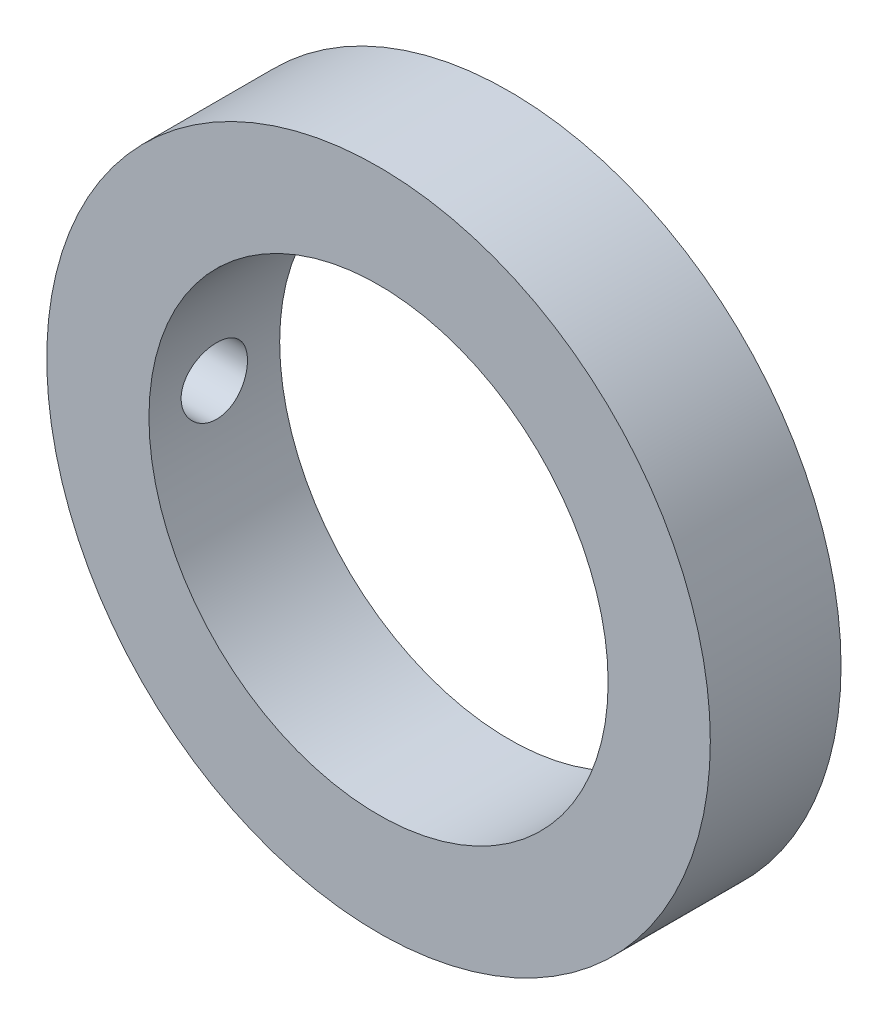
ISO-10303-21;
HEADER;
FILE_DESCRIPTION(('STEP AP214'),'2;1');
FILE_NAME('part.step','',(''),(''),'','','');
FILE_SCHEMA(('AUTOMOTIVE_DESIGN { 1 0 10303 214 1 1 1 1 }'));
ENDSEC;
DATA;
#1=APPLICATION_CONTEXT('core data for automotive mechanical design processes');
#2=APPLICATION_PROTOCOL_DEFINITION('international standard','automotive_design',2000,#1);
#3=PRODUCT_CONTEXT('',#1,'mechanical');
#4=PRODUCT('Part','Part','',(#3));
#5=PRODUCT_RELATED_PRODUCT_CATEGORY('part','',(#4));
#6=PRODUCT_DEFINITION_FORMATION('','',#4);
#7=PRODUCT_DEFINITION_CONTEXT('part definition',#1,'design');
#8=PRODUCT_DEFINITION('design','',#6,#7);
#9=PRODUCT_DEFINITION_SHAPE('','',#8);
#10=(LENGTH_UNIT() NAMED_UNIT(*) SI_UNIT(.MILLI.,.METRE.));
#11=(NAMED_UNIT(*) PLANE_ANGLE_UNIT() SI_UNIT($,.RADIAN.));
#12=(NAMED_UNIT(*) SI_UNIT($,.STERADIAN.) SOLID_ANGLE_UNIT());
#13=UNCERTAINTY_MEASURE_WITH_UNIT(LENGTH_MEASURE(1.E-05),#10,'distance_accuracy_value','');
#14=(GEOMETRIC_REPRESENTATION_CONTEXT(3) GLOBAL_UNCERTAINTY_ASSIGNED_CONTEXT((#13)) GLOBAL_UNIT_ASSIGNED_CONTEXT((#10,
#11,#12)) REPRESENTATION_CONTEXT('',''));
#15=CARTESIAN_POINT('',(0.,0.,0.));
#16=DIRECTION('',(0.,0.,1.));
#17=DIRECTION('',(1.,0.,0.));
#18=AXIS2_PLACEMENT_3D('',#15,#16,#17);
#19=CARTESIAN_POINT('',(0.,0.,9.85));
#20=DIRECTION('',(0.,0.,1.));
#21=DIRECTION('',(1.,0.,0.));
#22=AXIS2_PLACEMENT_3D('',#19,#20,#21);
#23=PLANE('',#22);
#24=CARTESIAN_POINT('',(0.,0.,9.85));
#25=DIRECTION('',(0.,0.,1.));
#26=DIRECTION('',(1.,0.,0.));
#27=AXIS2_PLACEMENT_3D('',#24,#25,#26);
#28=CIRCLE('',#27,25.);
#29=CARTESIAN_POINT('',(25.,0.,9.85));
#30=VERTEX_POINT('',#29);
#31=EDGE_CURVE('E10',#30,#30,#28,.T.);
#32=ORIENTED_EDGE('',*,*,#31,.T.);
#33=EDGE_LOOP('',(#32));
#34=FACE_BOUND('',#33,.T.);
#35=CARTESIAN_POINT('',(0.,0.,9.85));
#36=DIRECTION('',(0.,0.,1.));
#37=DIRECTION('',(1.,0.,0.));
#38=AXIS2_PLACEMENT_3D('',#35,#36,#37);
#39=CIRCLE('',#38,17.3);
#40=CARTESIAN_POINT('',(17.3,0.,9.85));
#41=VERTEX_POINT('',#40);
#42=EDGE_CURVE('E53',#41,#41,#39,.T.);
#43=ORIENTED_EDGE('',*,*,#42,.F.);
#44=EDGE_LOOP('',(#43));
#45=FACE_BOUND('',#44,.T.);
#46=ADVANCED_FACE('F35',(#34,#45),#23,.T.);
#47=CARTESIAN_POINT('',(0.,0.,0.));
#48=DIRECTION('',(0.,0.,1.));
#49=DIRECTION('',(1.,0.,0.));
#50=AXIS2_PLACEMENT_3D('',#47,#48,#49);
#51=PLANE('',#50);
#52=CARTESIAN_POINT('',(0.,0.,0.));
#53=DIRECTION('',(0.,0.,1.));
#54=DIRECTION('',(1.,0.,0.));
#55=AXIS2_PLACEMENT_3D('',#52,#53,#54);
#56=CIRCLE('',#55,25.);
#57=CARTESIAN_POINT('',(25.,0.,0.));
#58=VERTEX_POINT('',#57);
#59=EDGE_CURVE('E48',#58,#58,#56,.T.);
#60=ORIENTED_EDGE('',*,*,#59,.F.);
#61=EDGE_LOOP('',(#60));
#62=FACE_BOUND('',#61,.T.);
#63=CARTESIAN_POINT('',(0.,0.,0.));
#64=DIRECTION('',(0.,0.,1.));
#65=DIRECTION('',(1.,0.,0.));
#66=AXIS2_PLACEMENT_3D('',#63,#64,#65);
#67=CIRCLE('',#66,17.3);
#68=CARTESIAN_POINT('',(17.3,0.,0.));
#69=VERTEX_POINT('',#68);
#70=EDGE_CURVE('E55',#69,#69,#67,.T.);
#71=ORIENTED_EDGE('',*,*,#70,.T.);
#72=EDGE_LOOP('',(#71));
#73=FACE_BOUND('',#72,.T.);
#74=ADVANCED_FACE('F75',(#62,#73),#51,.F.);
#75=CARTESIAN_POINT('',(0.,0.,9.85));
#76=DIRECTION('',(0.,0.,-1.));
#77=DIRECTION('',(-1.,0.,0.));
#78=AXIS2_PLACEMENT_3D('',#75,#76,#77);
#79=CYLINDRICAL_SURFACE('',#78,25.);
#80=CARTESIAN_POINT('',(-25.,0.,2.425));
#81=CARTESIAN_POINT('',(-24.9999983880192,0.140050884478893,2.42500606475095));
#82=CARTESIAN_POINT('',(-24.9988106399051,0.280194362919433,2.43680817224111));
#83=CARTESIAN_POINT('',(-24.9941866898684,0.556595996242092,2.48371092572607));
#84=CARTESIAN_POINT('',(-24.9907480108506,0.69284969792207,2.51883724006147));
#85=CARTESIAN_POINT('',(-24.9820103640768,0.957429188633536,2.61135560149458));
#86=CARTESIAN_POINT('',(-24.9767125200177,1.08575971153727,2.66873420129619));
#87=CARTESIAN_POINT('',(-24.9648489348577,1.33094040240102,2.80410226982911));
#88=CARTESIAN_POINT('',(-24.9582834459533,1.44779284694769,2.88208764000035));
#89=CARTESIAN_POINT('',(-24.9445936085331,1.6671488766852,3.05675674415569));
#90=CARTESIAN_POINT('',(-24.9374675393466,1.76960536208723,3.15349949850508));
#91=CARTESIAN_POINT('',(-24.9234739226566,1.95685630357746,3.36281133565757));
#92=CARTESIAN_POINT('',(-24.9166063871229,2.04164994270663,3.47538115010597));
#93=CARTESIAN_POINT('',(-24.9038897888196,2.19133492610904,3.71344632920905));
#94=CARTESIAN_POINT('',(-24.8980429177726,2.2561836636372,3.83896861023715));
#95=CARTESIAN_POINT('',(-24.8880509386631,2.3638659618569,4.09918896476245));
#96=CARTESIAN_POINT('',(-24.8839057885556,2.40670006647823,4.23388681145987));
#97=CARTESIAN_POINT('',(-24.8778021018244,2.46899760400473,4.50815450216502));
#98=CARTESIAN_POINT('',(-24.8758362599524,2.48853913250949,4.64770644213052));
#99=CARTESIAN_POINT('',(-24.8742910765131,2.5039382128384,4.92812215848945));
#100=CARTESIAN_POINT('',(-24.8747116722186,2.499796387177,5.06898590030515));
#101=CARTESIAN_POINT('',(-24.8778851724734,2.4680107006317,5.3474882742333));
#102=CARTESIAN_POINT('',(-24.8806296147663,2.44045211031138,5.48513674832174));
#103=CARTESIAN_POINT('',(-24.8881283571855,2.36274786037647,5.75384490800274));
#104=CARTESIAN_POINT('',(-24.8928826844623,2.31260189563937,5.88490450456258));
#105=CARTESIAN_POINT('',(-24.9038752363018,2.19105223470377,6.13698396824722));
#106=CARTESIAN_POINT('',(-24.9101160977039,2.11961070679995,6.25798547372329));
#107=CARTESIAN_POINT('',(-24.923376293322,1.95752506838307,6.48631303727971));
#108=CARTESIAN_POINT('',(-24.9303956503196,1.86688039584126,6.59363869495441));
#109=CARTESIAN_POINT('',(-24.9444596328247,1.66848528103017,6.79206348497257));
#110=CARTESIAN_POINT('',(-24.9515042333249,1.56066119712841,6.88308900470201));
#111=CARTESIAN_POINT('',(-24.964795726963,1.33122370434278,7.04575908227597));
#112=CARTESIAN_POINT('',(-24.9710426192064,1.209610279999,7.11740361839119));
#113=CARTESIAN_POINT('',(-24.9820368916774,0.955995264230911,7.23927505077563));
#114=CARTESIAN_POINT('',(-24.9867840103692,0.823991865974758,7.28949821204515));
#115=CARTESIAN_POINT('',(-24.9942411860352,0.55336804332483,7.36704729177938));
#116=CARTESIAN_POINT('',(-24.9969513039266,0.4147478169415,7.39437389497656));
#117=CARTESIAN_POINT('',(-25.0000212917078,0.135462747729759,7.42526076933691));
#118=CARTESIAN_POINT('',(-25.0003912066934,-0.00519075526373019,7.42892262063125));
#119=CARTESIAN_POINT('',(-24.9987660439199,-0.28510948328925,7.41264284237809));
#120=CARTESIAN_POINT('',(-24.9967709981117,-0.424374727051175,7.3927015317118));
#121=CARTESIAN_POINT('',(-24.9906465384799,-0.697270517086687,7.32986576144606));
#122=CARTESIAN_POINT('',(-24.986521547951,-0.830912122430048,7.28701886380497));
#123=CARTESIAN_POINT('',(-24.9765999715152,-1.08911080345945,7.17963706490682));
#124=CARTESIAN_POINT('',(-24.9708033481313,-1.21366767539279,7.11510167740151));
#125=CARTESIAN_POINT('',(-24.9581618832606,-1.45062045043036,6.96592290334022));
#126=CARTESIAN_POINT('',(-24.951313590086,-1.56297414937229,6.88121277768546));
#127=CARTESIAN_POINT('',(-24.937348321738,-1.7719040582797,6.69418483064768));
#128=CARTESIAN_POINT('',(-24.9302313398243,-1.86847987212294,6.59186656732421));
#129=CARTESIAN_POINT('',(-24.9165006035189,-2.04346527471786,6.3720835633525));
#130=CARTESIAN_POINT('',(-24.9098887534744,-2.12180819669886,6.25456560864345));
#131=CARTESIAN_POINT('',(-24.8979458115222,-2.25764564685957,6.00798159963329));
#132=CARTESIAN_POINT('',(-24.8926147021009,-2.3151404601347,5.87891570327901));
#133=CARTESIAN_POINT('',(-24.8838486908512,-2.40753802171119,5.61312815133551));
#134=CARTESIAN_POINT('',(-24.8804104612447,-2.44248043702965,5.4764203997722));
#135=CARTESIAN_POINT('',(-24.8758091320719,-2.48891001782366,5.19904200509807));
#136=CARTESIAN_POINT('',(-24.8746459672547,-2.50039785599879,5.05837147576081));
#137=CARTESIAN_POINT('',(-24.8747278276891,-2.49958284617814,4.77772327910824));
#138=CARTESIAN_POINT('',(-24.8759622521752,-2.48738472398278,4.63774529279296));
#139=CARTESIAN_POINT('',(-24.8806775972386,-2.43976363240913,4.36183770707928));
#140=CARTESIAN_POINT('',(-24.884158520343,-2.4043406369054,4.22590811223505));
#141=CARTESIAN_POINT('',(-24.8929717065797,-2.31130421574376,3.96195662738036));
#142=CARTESIAN_POINT('',(-24.898303713509,-2.25369386085229,3.83393364592569));
#143=CARTESIAN_POINT('',(-24.910218795984,-2.11792888727761,3.58935777082241));
#144=CARTESIAN_POINT('',(-24.9168018645238,-2.03977438363854,3.47280481294843));
#145=CARTESIAN_POINT('',(-24.9305121802424,-1.86474639071333,3.25394081382016));
#146=CARTESIAN_POINT('',(-24.9376416181688,-1.76779487222567,3.15169230908228));
#147=CARTESIAN_POINT('',(-24.9516213682196,-1.55807924806277,2.96486941825086));
#148=CARTESIAN_POINT('',(-24.9584716130744,-1.44531136027064,2.88029927160708));
#149=CARTESIAN_POINT('',(-24.971139051729,-1.20685358540322,2.73106636536345));
#150=CARTESIAN_POINT('',(-24.9769536006703,-1.08113187336691,2.66645427263704));
#151=CARTESIAN_POINT('',(-24.9868657312474,-0.820645697751377,2.55934394294033));
#152=CARTESIAN_POINT('',(-24.9909652477413,-0.685891624564023,2.51682077261613));
#153=CARTESIAN_POINT('',(-24.9959553443433,-0.45864565351426,2.465698457288));
#154=CARTESIAN_POINT('',(-24.9974650172958,-0.367606382111272,2.45045738925161));
#155=CARTESIAN_POINT('',(-24.9994878737697,-0.184391452043283,2.4301061848456));
#156=CARTESIAN_POINT('',(-25.0000010614006,-0.0922157980663947,2.42499600669535));
#157=CARTESIAN_POINT('',(-25.,0.,2.425));
#158=B_SPLINE_CURVE_WITH_KNOTS('',3,(#80,#81,#82,#83,#84,#85,#86,#87,#88,#89,#90,#91,#92,#93,
#94,#95,#96,#97,#98,#99,#100,#101,#102,#103,#104,#105,#106,#107,#108,#109,#110,#111,#112,#113,
#114,#115,#116,#117,#118,#119,#120,#121,#122,#123,#124,#125,#126,#127,#128,#129,#130,#131,#132,
#133,#134,#135,#136,#137,#138,#139,#140,#141,#142,#143,#144,#145,#146,#147,#148,#149,#150,#151,
#152,#153,#154,#155,#156,#157),.UNSPECIFIED.,.T.,.F.,(4,2,2,2,2,2,2,2,2,2,2,2,2,2,2,2,2,2,2,2,2,
2,2,2,2,2,2,2,2,2,2,2,2,2,2,2,2,2,4),(0.,0.419815915671184,0.840094607088716,1.26011971433051,
1.68006134395696,2.10134642155736,2.52265098051764,2.94484938680554,3.3670373610626,
3.78780580112991,4.20856318139441,4.62779493602776,5.04703235404084,5.46701903432237,
5.88701800827813,6.30886835490516,6.73071917449429,7.15264351733954,7.57455524188599,
7.99465471519394,8.41474851297858,8.83397338235762,9.25320765123667,9.67384851871746,
10.0944999452557,10.516666090215,10.9388264618843,11.3602422648251,11.7816459809896,
12.2011907323489,12.620735955651,13.04022313407,13.459707963474,13.8809729356913,
14.3023388159239,14.7247657756561,15.1467148698824,15.4231416808087,15.6995673517257),.UNSPECIFIED.);
#159=CARTESIAN_POINT('',(-25.,0.,2.425));
#160=VERTEX_POINT('',#159);
#161=EDGE_CURVE('E58',#160,#160,#158,.T.);
#162=ORIENTED_EDGE('',*,*,#161,.T.);
#163=EDGE_LOOP('',(#162));
#164=FACE_BOUND('',#163,.T.);
#165=ORIENTED_EDGE('',*,*,#31,.F.);
#166=EDGE_LOOP('',(#165));
#167=FACE_BOUND('',#166,.T.);
#168=ORIENTED_EDGE('',*,*,#59,.T.);
#169=EDGE_LOOP('',(#168));
#170=FACE_BOUND('',#169,.T.);
#171=ADVANCED_FACE('F37',(#164,#167,#170),#79,.T.);
#172=CARTESIAN_POINT('',(0.,0.,9.85));
#173=DIRECTION('',(0.,0.,-1.));
#174=DIRECTION('',(-1.,0.,0.));
#175=AXIS2_PLACEMENT_3D('',#172,#173,#174);
#176=CYLINDRICAL_SURFACE('',#175,17.3);
#177=CARTESIAN_POINT('',(-17.3,0.,7.425));
#178=CARTESIAN_POINT('',(-17.2999978201759,-0.139645816934758,7.42499419685998));
#179=CARTESIAN_POINT('',(-17.2982914133815,-0.279374132613077,7.41325993753946));
#180=CARTESIAN_POINT('',(-17.291648424259,-0.554929247286553,7.36664248821829));
#181=CARTESIAN_POINT('',(-17.2867086432826,-0.690752043664003,7.33173637474039));
#182=CARTESIAN_POINT('',(-17.2741543489032,-0.954468074721386,7.23983653919054));
#183=CARTESIAN_POINT('',(-17.2665418059003,-1.08236706945153,7.18285908525345));
#184=CARTESIAN_POINT('',(-17.2494844546728,-1.32676787355446,7.04847276995523));
#185=CARTESIAN_POINT('',(-17.2400399149195,-1.44327134913407,6.97106690169362));
#186=CARTESIAN_POINT('',(-17.2202930217388,-1.66244187947045,6.79742083546783));
#187=CARTESIAN_POINT('',(-17.2099854911148,-1.76501406604262,6.70106147410029));
#188=CARTESIAN_POINT('',(-17.1897151433582,-1.95259219038987,6.49250005849909));
#189=CARTESIAN_POINT('',(-17.1797523455219,-2.03759714615651,6.38029711919905));
#190=CARTESIAN_POINT('',(-17.161249142452,-2.18799359570278,6.14260079746725));
#191=CARTESIAN_POINT('',(-17.1527154255121,-2.25329395162093,6.0170491840818));
#192=CARTESIAN_POINT('',(-17.1381068195398,-2.36184524273329,5.75661664370561));
#193=CARTESIAN_POINT('',(-17.132031806193,-2.40509729274055,5.62173618879425));
#194=CARTESIAN_POINT('',(-17.1230790643525,-2.46803097872515,5.34746969802038));
#195=CARTESIAN_POINT('',(-17.120179378477,-2.48787455897951,5.20812155187881));
#196=CARTESIAN_POINT('',(-17.1178388402486,-2.50392957397871,4.92804535465565));
#197=CARTESIAN_POINT('',(-17.1183978033616,-2.50014226953478,4.78731737759407));
#198=CARTESIAN_POINT('',(-17.1228913226201,-2.46917550347102,4.50961662331896));
#199=CARTESIAN_POINT('',(-17.1267999180612,-2.44217593904368,4.37262330514671));
#200=CARTESIAN_POINT('',(-17.1375117665441,-2.36583246476306,4.10513211424511));
#201=CARTESIAN_POINT('',(-17.1443150960673,-2.31648796453425,3.97463441323758));
#202=CARTESIAN_POINT('',(-17.1600787089467,-2.19666676178105,3.72328875680966));
#203=CARTESIAN_POINT('',(-17.1690467934854,-2.12611339742947,3.602477856814));
#204=CARTESIAN_POINT('',(-17.1881237178703,-1.96593186934031,3.37434175640002));
#205=CARTESIAN_POINT('',(-17.1982326272594,-1.87630254246741,3.26701737894213));
#206=CARTESIAN_POINT('',(-17.2185670602858,-1.67952361679385,3.06785787679399));
#207=CARTESIAN_POINT('',(-17.2287927960124,-1.57221925416408,2.97617561860796));
#208=CARTESIAN_POINT('',(-17.2481214975463,-1.34366496886468,2.812098246127));
#209=CARTESIAN_POINT('',(-17.2572244590545,-1.22241499280033,2.73970320568215));
#210=CARTESIAN_POINT('',(-17.2732904974351,-0.969282254474727,2.61624926675159));
#211=CARTESIAN_POINT('',(-17.2802524433076,-0.837393918732258,2.56520164001488));
#212=CARTESIAN_POINT('',(-17.2912424171551,-0.566793788766761,2.48602175730076));
#213=CARTESIAN_POINT('',(-17.2952706290923,-0.428082422969733,2.45788806447353));
#214=CARTESIAN_POINT('',(-17.2999150096685,-0.149093646141947,2.42553672310707));
#215=CARTESIAN_POINT('',(-17.3005611741196,-0.00884109709995752,2.42110881684821));
#216=CARTESIAN_POINT('',(-17.2984501504464,0.270404402272992,2.43573740648509));
#217=CARTESIAN_POINT('',(-17.2956930598995,0.409397388602738,2.45479322906088));
#218=CARTESIAN_POINT('',(-17.2871038832377,0.681545252144678,2.51567354273551));
#219=CARTESIAN_POINT('',(-17.2812855661237,0.814723402052435,2.55739610890751));
#220=CARTESIAN_POINT('',(-17.2672244370448,1.07219381027276,2.66231843185477));
#221=CARTESIAN_POINT('',(-17.2589815183838,1.19648567723974,2.72551913380758));
#222=CARTESIAN_POINT('',(-17.2409132362758,1.43358329930099,2.87210058345008));
#223=CARTESIAN_POINT('',(-17.2310775167095,1.54630541080518,2.95561532620201));
#224=CARTESIAN_POINT('',(-17.2109520413726,1.75620877253706,3.14026692537345));
#225=CARTESIAN_POINT('',(-17.2006622612283,1.85338918720038,3.24140472864677));
#226=CARTESIAN_POINT('',(-17.1806938652141,2.03021116671282,3.45936529915273));
#227=CARTESIAN_POINT('',(-17.1710205562987,2.10971214547735,3.5763026772208));
#228=CARTESIAN_POINT('',(-17.1534727983486,2.24794272461932,3.82199505023332));
#229=CARTESIAN_POINT('',(-17.1455983035092,2.30667285392303,3.95074974414658));
#230=CARTESIAN_POINT('',(-17.1325776873056,2.40147441022584,4.21599460993596));
#231=CARTESIAN_POINT('',(-17.1274225178681,2.4376210547685,4.35245743460012));
#232=CARTESIAN_POINT('',(-17.1203997546784,2.48646968689178,4.62959650241711));
#233=CARTESIAN_POINT('',(-17.1185319515686,2.49917316746437,4.77027247667309));
#234=CARTESIAN_POINT('',(-17.1183028302105,2.50074124817099,5.0504439888495));
#235=CARTESIAN_POINT('',(-17.119909005581,2.48982684288534,5.18993831388929));
#236=CARTESIAN_POINT('',(-17.1263763992813,2.44494123724216,5.46508590646697));
#237=CARTESIAN_POINT('',(-17.1312376138471,2.41097006354583,5.6007391784462));
#238=CARTESIAN_POINT('',(-17.1436562918359,2.32101131591695,5.8643002112618));
#239=CARTESIAN_POINT('',(-17.1512119996266,2.26503807529579,5.99221295221415));
#240=CARTESIAN_POINT('',(-17.1681706233429,2.13268592744918,6.23686745748287));
#241=CARTESIAN_POINT('',(-17.1775735926996,2.05630642996186,6.35360889853074));
#242=CARTESIAN_POINT('',(-17.1972721908687,1.88450282377578,6.57373150668028));
#243=CARTESIAN_POINT('',(-17.2075750407641,1.78891475043689,6.67698406823746));
#244=CARTESIAN_POINT('',(-17.2278514147081,1.58175355411602,6.86606280132252));
#245=CARTESIAN_POINT('',(-17.2378248614293,1.47017671013287,6.95188490506098));
#246=CARTESIAN_POINT('',(-17.256376340429,1.23353993369959,7.10405338244972));
#247=CARTESIAN_POINT('',(-17.2649470102126,1.10841425117706,7.17029838154001));
#248=CARTESIAN_POINT('',(-17.2796546862574,0.848750479164292,7.2807347941519));
#249=CARTESIAN_POINT('',(-17.2857942409709,0.714222420885036,7.32494931407991));
#250=CARTESIAN_POINT('',(-17.2935278661997,0.482556802993806,7.37990809416754));
#251=CARTESIAN_POINT('',(-17.2959426037763,0.38685705659139,7.39679208464159));
#252=CARTESIAN_POINT('',(-17.2991794195048,0.194118153395144,7.41933999227575));
#253=CARTESIAN_POINT('',(-17.3000015153706,0.0970790115106507,7.42500403422823));
#254=CARTESIAN_POINT('',(-17.3,0.,7.425));
#255=B_SPLINE_CURVE_WITH_KNOTS('',3,(#177,#178,#179,#180,#181,#182,#183,#184,#185,#186,#187,
#188,#189,#190,#191,#192,#193,#194,#195,#196,#197,#198,#199,#200,#201,#202,#203,#204,#205,#206,
#207,#208,#209,#210,#211,#212,#213,#214,#215,#216,#217,#218,#219,#220,#221,#222,#223,#224,#225,
#226,#227,#228,#229,#230,#231,#232,#233,#234,#235,#236,#237,#238,#239,#240,#241,#242,#243,#244,
#245,#246,#247,#248,#249,#250,#251,#252,#253,#254),.UNSPECIFIED.,.T.,.F.,(4,2,2,2,2,2,2,2,2,2,2,
2,2,2,2,2,2,2,2,2,2,2,2,2,2,2,2,2,2,2,2,2,2,2,2,2,2,2,4),(0.,0.418582747001824,
0.837580208341922,1.25626942482992,1.67489733046847,2.09624656776445,2.51761935212105,
2.94091220992749,3.36418366295005,3.784509342114,4.20481259525338,4.62188752436386,
5.03897347365375,5.45758553515162,5.8762231283646,6.29874289163025,6.7212642726861,
7.14400847042422,7.56672615736319,7.985688275109,8.40463838075101,8.82172001249182,
9.2388200009119,9.65874964521786,10.0787018585127,10.5018827422081,10.925052848896,
11.3468059060965,11.7685321027736,12.1863292466554,12.6041259074273,13.021650843209,
13.4391878574301,13.8604531734295,14.2818166884864,14.7053253498077,15.1283888791316,
15.4193825671483,15.7103730186083),.UNSPECIFIED.);
#256=CARTESIAN_POINT('',(-17.3,0.,7.425));
#257=VERTEX_POINT('',#256);
#258=EDGE_CURVE('E40',#257,#257,#255,.T.);
#259=ORIENTED_EDGE('',*,*,#258,.F.);
#260=EDGE_LOOP('',(#259));
#261=FACE_BOUND('',#260,.T.);
#262=ORIENTED_EDGE('',*,*,#42,.T.);
#263=EDGE_LOOP('',(#262));
#264=FACE_BOUND('',#263,.T.);
#265=ORIENTED_EDGE('',*,*,#70,.F.);
#266=EDGE_LOOP('',(#265));
#267=FACE_BOUND('',#266,.T.);
#268=ADVANCED_FACE('F67',(#261,#264,#267),#176,.F.);
#269=CARTESIAN_POINT('',(-25.,0.,4.925));
#270=DIRECTION('',(1.,0.,0.));
#271=DIRECTION('',(0.,0.,-1.));
#272=AXIS2_PLACEMENT_3D('',#269,#270,#271);
#273=CYLINDRICAL_SURFACE('',#272,2.5);
#274=ORIENTED_EDGE('',*,*,#258,.T.);
#275=EDGE_LOOP('',(#274));
#276=FACE_BOUND('',#275,.T.);
#277=ORIENTED_EDGE('',*,*,#161,.F.);
#278=EDGE_LOOP('',(#277));
#279=FACE_BOUND('',#278,.T.);
#280=ADVANCED_FACE('F64',(#276,#279),#273,.F.);
#281=CLOSED_SHELL('',(#46,#74,#171,#268,#280));
#282=MANIFOLD_SOLID_BREP('B2',#281);
#283=ADVANCED_BREP_SHAPE_REPRESENTATION('',(#18,#282),#14);
#284=SHAPE_DEFINITION_REPRESENTATION(#9,#283);
ENDSEC;
END-ISO-10303-21;
